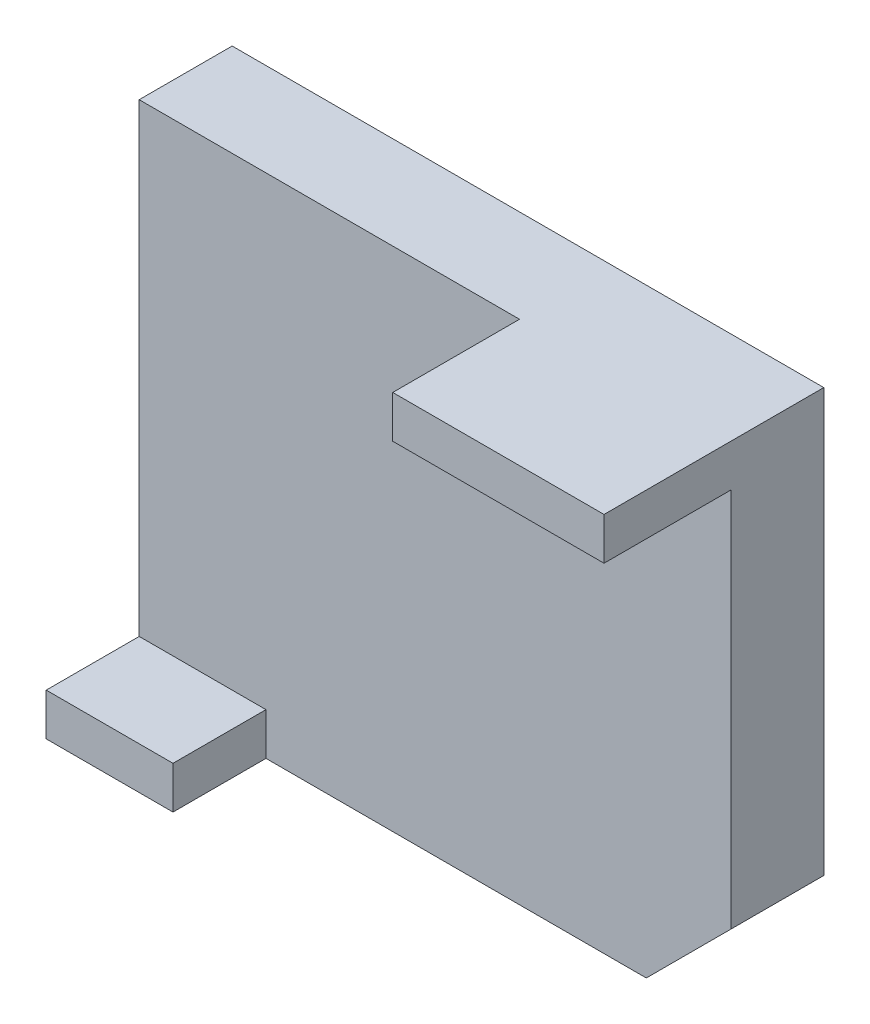
ISO-10303-21;
HEADER;
FILE_DESCRIPTION(('STEP AP214'),'2;1');
FILE_NAME('part.step','',(''),(''),'','','');
FILE_SCHEMA(('AUTOMOTIVE_DESIGN { 1 0 10303 214 1 1 1 1 }'));
ENDSEC;
DATA;
#1=APPLICATION_CONTEXT('core data for automotive mechanical design processes');
#2=APPLICATION_PROTOCOL_DEFINITION('international standard','automotive_design',2000,#1);
#3=PRODUCT_CONTEXT('',#1,'mechanical');
#4=PRODUCT('Part','Part','',(#3));
#5=PRODUCT_RELATED_PRODUCT_CATEGORY('part','',(#4));
#6=PRODUCT_DEFINITION_FORMATION('','',#4);
#7=PRODUCT_DEFINITION_CONTEXT('part definition',#1,'design');
#8=PRODUCT_DEFINITION('design','',#6,#7);
#9=PRODUCT_DEFINITION_SHAPE('','',#8);
#10=(LENGTH_UNIT() NAMED_UNIT(*) SI_UNIT(.MILLI.,.METRE.));
#11=(NAMED_UNIT(*) PLANE_ANGLE_UNIT() SI_UNIT($,.RADIAN.));
#12=(NAMED_UNIT(*) SI_UNIT($,.STERADIAN.) SOLID_ANGLE_UNIT());
#13=UNCERTAINTY_MEASURE_WITH_UNIT(LENGTH_MEASURE(1.E-05),#10,'distance_accuracy_value','');
#14=(GEOMETRIC_REPRESENTATION_CONTEXT(3) GLOBAL_UNCERTAINTY_ASSIGNED_CONTEXT((#13)) GLOBAL_UNIT_ASSIGNED_CONTEXT((#10,
#11,#12)) REPRESENTATION_CONTEXT('',''));
#15=CARTESIAN_POINT('',(0.,0.,0.));
#16=DIRECTION('',(0.,0.,1.));
#17=DIRECTION('',(1.,0.,0.));
#18=AXIS2_PLACEMENT_3D('',#15,#16,#17);
#19=CARTESIAN_POINT('',(0.,0.,22.));
#20=DIRECTION('',(0.,1.,0.));
#21=DIRECTION('',(0.,0.,1.));
#22=AXIS2_PLACEMENT_3D('',#19,#20,#21);
#23=PLANE('',#22);
#24=DIRECTION('',(1.,0.,0.));
#25=VECTOR('',#24,1.);
#26=CARTESIAN_POINT('',(0.,0.,0.));
#27=LINE('',#26,#25);
#28=CARTESIAN_POINT('',(0.,0.,0.));
#29=VERTEX_POINT('',#28);
#30=CARTESIAN_POINT('',(140.,0.,0.));
#31=VERTEX_POINT('',#30);
#32=EDGE_CURVE('E176',#29,#31,#27,.T.);
#33=ORIENTED_EDGE('',*,*,#32,.F.);
#34=DIRECTION('',(0.,0.,-1.));
#35=VECTOR('',#34,1.);
#36=CARTESIAN_POINT('',(0.,0.,22.));
#37=LINE('',#36,#35);
#38=CARTESIAN_POINT('',(0.,0.,22.));
#39=VERTEX_POINT('',#38);
#40=EDGE_CURVE('E11',#39,#29,#37,.T.);
#41=ORIENTED_EDGE('',*,*,#40,.F.);
#42=DIRECTION('',(1.,0.,0.));
#43=VECTOR('',#42,1.);
#44=CARTESIAN_POINT('',(0.,0.,22.));
#45=LINE('',#44,#43);
#46=CARTESIAN_POINT('',(90.,0.,22.));
#47=VERTEX_POINT('',#46);
#48=EDGE_CURVE('E138',#39,#47,#45,.T.);
#49=ORIENTED_EDGE('',*,*,#48,.T.);
#50=DIRECTION('',(0.,0.,-1.));
#51=VECTOR('',#50,1.);
#52=CARTESIAN_POINT('',(90.,0.,52.));
#53=LINE('',#52,#51);
#54=CARTESIAN_POINT('',(90.,0.,52.));
#55=VERTEX_POINT('',#54);
#56=EDGE_CURVE('E136',#55,#47,#53,.T.);
#57=ORIENTED_EDGE('',*,*,#56,.F.);
#58=DIRECTION('',(1.,0.,0.));
#59=VECTOR('',#58,1.);
#60=CARTESIAN_POINT('',(0.,0.,52.));
#61=LINE('',#60,#59);
#62=CARTESIAN_POINT('',(140.,0.,52.));
#63=VERTEX_POINT('',#62);
#64=EDGE_CURVE('E126',#55,#63,#61,.T.);
#65=ORIENTED_EDGE('',*,*,#64,.T.);
#66=DIRECTION('',(0.,0.,-1.));
#67=VECTOR('',#66,1.);
#68=CARTESIAN_POINT('',(140.,0.,52.));
#69=LINE('',#68,#67);
#70=EDGE_CURVE('E134',#63,#31,#69,.T.);
#71=ORIENTED_EDGE('',*,*,#70,.T.);
#72=EDGE_LOOP('',(#33,#41,#49,#57,#65,#71));
#73=FACE_BOUND('',#72,.T.);
#74=ADVANCED_FACE('F39',(#73),#23,.T.);
#75=CARTESIAN_POINT('',(0.,0.,22.));
#76=DIRECTION('',(1.,0.,0.));
#77=DIRECTION('',(0.,1.,0.));
#78=AXIS2_PLACEMENT_3D('',#75,#76,#77);
#79=PLANE('',#78);
#80=DIRECTION('',(0.,-1.,0.));
#81=VECTOR('',#80,1.);
#82=CARTESIAN_POINT('',(0.,0.,0.));
#83=LINE('',#82,#81);
#84=CARTESIAN_POINT('',(0.,-120.,0.));
#85=VERTEX_POINT('',#84);
#86=EDGE_CURVE('E198',#29,#85,#83,.T.);
#87=ORIENTED_EDGE('',*,*,#86,.T.);
#88=DIRECTION('',(0.,0.,-1.));
#89=VECTOR('',#88,1.);
#90=CARTESIAN_POINT('',(0.,-120.,44.));
#91=LINE('',#90,#89);
#92=CARTESIAN_POINT('',(0.,-120.,44.));
#93=VERTEX_POINT('',#92);
#94=EDGE_CURVE('E167',#93,#85,#91,.T.);
#95=ORIENTED_EDGE('',*,*,#94,.F.);
#96=DIRECTION('',(0.,-1.,0.));
#97=VECTOR('',#96,1.);
#98=CARTESIAN_POINT('',(0.,0.,44.));
#99=LINE('',#98,#97);
#100=CARTESIAN_POINT('',(0.,-110.,44.));
#101=VERTEX_POINT('',#100);
#102=EDGE_CURVE('E161',#101,#93,#99,.T.);
#103=ORIENTED_EDGE('',*,*,#102,.F.);
#104=DIRECTION('',(0.,0.,-1.));
#105=VECTOR('',#104,1.);
#106=CARTESIAN_POINT('',(0.,-110.,44.));
#107=LINE('',#106,#105);
#108=CARTESIAN_POINT('',(0.,-110.,22.));
#109=VERTEX_POINT('',#108);
#110=EDGE_CURVE('E170',#101,#109,#107,.T.);
#111=ORIENTED_EDGE('',*,*,#110,.T.);
#112=DIRECTION('',(0.,-1.,0.));
#113=VECTOR('',#112,1.);
#114=CARTESIAN_POINT('',(0.,0.,22.));
#115=LINE('',#114,#113);
#116=EDGE_CURVE('E183',#39,#109,#115,.T.);
#117=ORIENTED_EDGE('',*,*,#116,.F.);
#118=ORIENTED_EDGE('',*,*,#40,.T.);
#119=EDGE_LOOP('',(#87,#95,#103,#111,#117,#118));
#120=FACE_BOUND('',#119,.T.);
#121=ADVANCED_FACE('F229',(#120),#79,.F.);
#122=CARTESIAN_POINT('',(0.,-120.,22.));
#123=DIRECTION('',(0.,-1.,0.));
#124=DIRECTION('',(0.,0.,-1.));
#125=AXIS2_PLACEMENT_3D('',#122,#123,#124);
#126=PLANE('',#125);
#127=DIRECTION('',(-1.,0.,0.));
#128=VECTOR('',#127,1.);
#129=CARTESIAN_POINT('',(0.,-120.,0.));
#130=LINE('',#129,#128);
#131=CARTESIAN_POINT('',(120.,-120.,0.));
#132=VERTEX_POINT('',#131);
#133=EDGE_CURVE('E201',#132,#85,#130,.T.);
#134=ORIENTED_EDGE('',*,*,#133,.F.);
#135=DIRECTION('',(0.,0.,-1.));
#136=VECTOR('',#135,1.);
#137=CARTESIAN_POINT('',(120.,-120.,22.));
#138=LINE('',#137,#136);
#139=CARTESIAN_POINT('',(120.,-120.,22.));
#140=VERTEX_POINT('',#139);
#141=EDGE_CURVE('E47',#140,#132,#138,.T.);
#142=ORIENTED_EDGE('',*,*,#141,.F.);
#143=DIRECTION('',(-1.,0.,0.));
#144=VECTOR('',#143,1.);
#145=CARTESIAN_POINT('',(0.,-120.,22.));
#146=LINE('',#145,#144);
#147=CARTESIAN_POINT('',(30.,-120.,22.));
#148=VERTEX_POINT('',#147);
#149=EDGE_CURVE('E190',#140,#148,#146,.T.);
#150=ORIENTED_EDGE('',*,*,#149,.T.);
#151=DIRECTION('',(0.,0.,-1.));
#152=VECTOR('',#151,1.);
#153=CARTESIAN_POINT('',(30.,-120.,44.));
#154=LINE('',#153,#152);
#155=CARTESIAN_POINT('',(30.,-120.,44.));
#156=VERTEX_POINT('',#155);
#157=EDGE_CURVE('E165',#156,#148,#154,.T.);
#158=ORIENTED_EDGE('',*,*,#157,.F.);
#159=DIRECTION('',(1.,0.,0.));
#160=VECTOR('',#159,1.);
#161=CARTESIAN_POINT('',(0.,-120.,44.));
#162=LINE('',#161,#160);
#163=EDGE_CURVE('E163',#93,#156,#162,.T.);
#164=ORIENTED_EDGE('',*,*,#163,.F.);
#165=ORIENTED_EDGE('',*,*,#94,.T.);
#166=EDGE_LOOP('',(#134,#142,#150,#158,#164,#165));
#167=FACE_BOUND('',#166,.T.);
#168=ADVANCED_FACE('F222',(#167),#126,.T.);
#169=CARTESIAN_POINT('',(120.,-120.,22.));
#170=DIRECTION('',(0.707106781186548,-0.707106781186547,0.));
#171=DIRECTION('',(0.707106781186547,0.707106781186548,0.));
#172=AXIS2_PLACEMENT_3D('',#169,#170,#171);
#173=PLANE('',#172);
#174=DIRECTION('',(-0.707106781186547,-0.707106781186548,0.));
#175=VECTOR('',#174,1.);
#176=CARTESIAN_POINT('',(120.,-120.,0.));
#177=LINE('',#176,#175);
#178=CARTESIAN_POINT('',(140.,-100.,0.));
#179=VERTEX_POINT('',#178);
#180=EDGE_CURVE('E203',#179,#132,#177,.T.);
#181=ORIENTED_EDGE('',*,*,#180,.F.);
#182=DIRECTION('',(0.,0.,-1.));
#183=VECTOR('',#182,1.);
#184=CARTESIAN_POINT('',(140.,-100.,22.));
#185=LINE('',#184,#183);
#186=CARTESIAN_POINT('',(140.,-100.,22.));
#187=VERTEX_POINT('',#186);
#188=EDGE_CURVE('E55',#187,#179,#185,.T.);
#189=ORIENTED_EDGE('',*,*,#188,.F.);
#190=DIRECTION('',(-0.707106781186547,-0.707106781186548,0.));
#191=VECTOR('',#190,1.);
#192=CARTESIAN_POINT('',(120.,-120.,22.));
#193=LINE('',#192,#191);
#194=EDGE_CURVE('E193',#187,#140,#193,.T.);
#195=ORIENTED_EDGE('',*,*,#194,.T.);
#196=ORIENTED_EDGE('',*,*,#141,.T.);
#197=EDGE_LOOP('',(#181,#189,#195,#196));
#198=FACE_BOUND('',#197,.T.);
#199=ADVANCED_FACE('F220',(#198),#173,.T.);
#200=CARTESIAN_POINT('',(140.,0.,22.));
#201=DIRECTION('',(1.,0.,0.));
#202=DIRECTION('',(0.,0.,-1.));
#203=AXIS2_PLACEMENT_3D('',#200,#201,#202);
#204=PLANE('',#203);
#205=DIRECTION('',(0.,-1.,0.));
#206=VECTOR('',#205,1.);
#207=CARTESIAN_POINT('',(140.,0.,0.));
#208=LINE('',#207,#206);
#209=EDGE_CURVE('E180',#31,#179,#208,.T.);
#210=ORIENTED_EDGE('',*,*,#209,.F.);
#211=ORIENTED_EDGE('',*,*,#70,.F.);
#212=DIRECTION('',(0.,-1.,0.));
#213=VECTOR('',#212,1.);
#214=CARTESIAN_POINT('',(140.,0.,52.));
#215=LINE('',#214,#213);
#216=CARTESIAN_POINT('',(140.,-10.,52.));
#217=VERTEX_POINT('',#216);
#218=EDGE_CURVE('E132',#63,#217,#215,.T.);
#219=ORIENTED_EDGE('',*,*,#218,.T.);
#220=DIRECTION('',(0.,0.,-1.));
#221=VECTOR('',#220,1.);
#222=CARTESIAN_POINT('',(140.,-10.,52.));
#223=LINE('',#222,#221);
#224=CARTESIAN_POINT('',(140.,-10.,22.));
#225=VERTEX_POINT('',#224);
#226=EDGE_CURVE('E153',#217,#225,#223,.T.);
#227=ORIENTED_EDGE('',*,*,#226,.T.);
#228=DIRECTION('',(0.,-1.,0.));
#229=VECTOR('',#228,1.);
#230=CARTESIAN_POINT('',(140.,0.,22.));
#231=LINE('',#230,#229);
#232=EDGE_CURVE('E195',#225,#187,#231,.T.);
#233=ORIENTED_EDGE('',*,*,#232,.T.);
#234=ORIENTED_EDGE('',*,*,#188,.T.);
#235=EDGE_LOOP('',(#210,#211,#219,#227,#233,#234));
#236=FACE_BOUND('',#235,.T.);
#237=ADVANCED_FACE('F211',(#236),#204,.T.);
#238=CARTESIAN_POINT('',(0.,0.,22.));
#239=DIRECTION('',(0.,0.,1.));
#240=DIRECTION('',(1.,0.,0.));
#241=AXIS2_PLACEMENT_3D('',#238,#239,#240);
#242=PLANE('',#241);
#243=DIRECTION('',(1.,0.,0.));
#244=VECTOR('',#243,1.);
#245=CARTESIAN_POINT('',(0.,-10.,22.));
#246=LINE('',#245,#244);
#247=CARTESIAN_POINT('',(90.,-10.,22.));
#248=VERTEX_POINT('',#247);
#249=EDGE_CURVE('E177',#248,#225,#246,.T.);
#250=ORIENTED_EDGE('',*,*,#249,.F.);
#251=DIRECTION('',(0.,1.,0.));
#252=VECTOR('',#251,1.);
#253=CARTESIAN_POINT('',(90.,0.,22.));
#254=LINE('',#253,#252);
#255=EDGE_CURVE('E179',#248,#47,#254,.T.);
#256=ORIENTED_EDGE('',*,*,#255,.T.);
#257=ORIENTED_EDGE('',*,*,#48,.F.);
#258=ORIENTED_EDGE('',*,*,#116,.T.);
#259=DIRECTION('',(-1.,0.,0.));
#260=VECTOR('',#259,1.);
#261=CARTESIAN_POINT('',(0.,-110.,22.));
#262=LINE('',#261,#260);
#263=CARTESIAN_POINT('',(30.,-110.,22.));
#264=VERTEX_POINT('',#263);
#265=EDGE_CURVE('E186',#264,#109,#262,.T.);
#266=ORIENTED_EDGE('',*,*,#265,.F.);
#267=DIRECTION('',(0.,1.,0.));
#268=VECTOR('',#267,1.);
#269=CARTESIAN_POINT('',(30.,0.,22.));
#270=LINE('',#269,#268);
#271=EDGE_CURVE('E188',#148,#264,#270,.T.);
#272=ORIENTED_EDGE('',*,*,#271,.F.);
#273=ORIENTED_EDGE('',*,*,#149,.F.);
#274=ORIENTED_EDGE('',*,*,#194,.F.);
#275=ORIENTED_EDGE('',*,*,#232,.F.);
#276=EDGE_LOOP('',(#250,#256,#257,#258,#266,#272,#273,#274,#275));
#277=FACE_BOUND('',#276,.T.);
#278=ADVANCED_FACE('F217',(#277),#242,.T.);
#279=CARTESIAN_POINT('',(0.,0.,0.));
#280=DIRECTION('',(0.,0.,1.));
#281=DIRECTION('',(1.,0.,0.));
#282=AXIS2_PLACEMENT_3D('',#279,#280,#281);
#283=PLANE('',#282);
#284=ORIENTED_EDGE('',*,*,#32,.T.);
#285=ORIENTED_EDGE('',*,*,#209,.T.);
#286=ORIENTED_EDGE('',*,*,#180,.T.);
#287=ORIENTED_EDGE('',*,*,#133,.T.);
#288=ORIENTED_EDGE('',*,*,#86,.F.);
#289=EDGE_LOOP('',(#284,#285,#286,#287,#288));
#290=FACE_BOUND('',#289,.T.);
#291=ADVANCED_FACE('F209',(#290),#283,.F.);
#292=CARTESIAN_POINT('',(30.,0.,44.));
#293=DIRECTION('',(-1.,0.,0.));
#294=DIRECTION('',(0.,0.,1.));
#295=AXIS2_PLACEMENT_3D('',#292,#293,#294);
#296=PLANE('',#295);
#297=ORIENTED_EDGE('',*,*,#271,.T.);
#298=DIRECTION('',(0.,0.,-1.));
#299=VECTOR('',#298,1.);
#300=CARTESIAN_POINT('',(30.,-110.,44.));
#301=LINE('',#300,#299);
#302=CARTESIAN_POINT('',(30.,-110.,44.));
#303=VERTEX_POINT('',#302);
#304=EDGE_CURVE('E173',#303,#264,#301,.T.);
#305=ORIENTED_EDGE('',*,*,#304,.F.);
#306=DIRECTION('',(0.,1.,0.));
#307=VECTOR('',#306,1.);
#308=CARTESIAN_POINT('',(30.,0.,44.));
#309=LINE('',#308,#307);
#310=EDGE_CURVE('E156',#156,#303,#309,.T.);
#311=ORIENTED_EDGE('',*,*,#310,.F.);
#312=ORIENTED_EDGE('',*,*,#157,.T.);
#313=EDGE_LOOP('',(#297,#305,#311,#312));
#314=FACE_BOUND('',#313,.T.);
#315=ADVANCED_FACE('F264',(#314),#296,.F.);
#316=CARTESIAN_POINT('',(0.,-110.,44.));
#317=DIRECTION('',(0.,-1.,0.));
#318=DIRECTION('',(1.,0.,0.));
#319=AXIS2_PLACEMENT_3D('',#316,#317,#318);
#320=PLANE('',#319);
#321=ORIENTED_EDGE('',*,*,#265,.T.);
#322=ORIENTED_EDGE('',*,*,#110,.F.);
#323=DIRECTION('',(-1.,0.,0.));
#324=VECTOR('',#323,1.);
#325=CARTESIAN_POINT('',(0.,-110.,44.));
#326=LINE('',#325,#324);
#327=EDGE_CURVE('E159',#303,#101,#326,.T.);
#328=ORIENTED_EDGE('',*,*,#327,.F.);
#329=ORIENTED_EDGE('',*,*,#304,.T.);
#330=EDGE_LOOP('',(#321,#322,#328,#329));
#331=FACE_BOUND('',#330,.T.);
#332=ADVANCED_FACE('F258',(#331),#320,.F.);
#333=CARTESIAN_POINT('',(0.,0.,44.));
#334=DIRECTION('',(0.,0.,1.));
#335=DIRECTION('',(1.,0.,0.));
#336=AXIS2_PLACEMENT_3D('',#333,#334,#335);
#337=PLANE('',#336);
#338=ORIENTED_EDGE('',*,*,#310,.T.);
#339=ORIENTED_EDGE('',*,*,#327,.T.);
#340=ORIENTED_EDGE('',*,*,#102,.T.);
#341=ORIENTED_EDGE('',*,*,#163,.T.);
#342=EDGE_LOOP('',(#338,#339,#340,#341));
#343=FACE_BOUND('',#342,.T.);
#344=ADVANCED_FACE('F245',(#343),#337,.T.);
#345=CARTESIAN_POINT('',(0.,-10.,52.));
#346=DIRECTION('',(0.,1.,0.));
#347=DIRECTION('',(-1.,0.,0.));
#348=AXIS2_PLACEMENT_3D('',#345,#346,#347);
#349=PLANE('',#348);
#350=ORIENTED_EDGE('',*,*,#249,.T.);
#351=ORIENTED_EDGE('',*,*,#226,.F.);
#352=DIRECTION('',(1.,0.,0.));
#353=VECTOR('',#352,1.);
#354=CARTESIAN_POINT('',(0.,-10.,52.));
#355=LINE('',#354,#353);
#356=CARTESIAN_POINT('',(90.,-10.,52.));
#357=VERTEX_POINT('',#356);
#358=EDGE_CURVE('E141',#357,#217,#355,.T.);
#359=ORIENTED_EDGE('',*,*,#358,.F.);
#360=DIRECTION('',(0.,0.,-1.));
#361=VECTOR('',#360,1.);
#362=CARTESIAN_POINT('',(90.,-10.,52.));
#363=LINE('',#362,#361);
#364=EDGE_CURVE('E142',#357,#248,#363,.T.);
#365=ORIENTED_EDGE('',*,*,#364,.T.);
#366=EDGE_LOOP('',(#350,#351,#359,#365));
#367=FACE_BOUND('',#366,.T.);
#368=ADVANCED_FACE('F250',(#367),#349,.F.);
#369=CARTESIAN_POINT('',(0.,0.,52.));
#370=DIRECTION('',(0.,0.,1.));
#371=DIRECTION('',(1.,0.,0.));
#372=AXIS2_PLACEMENT_3D('',#369,#370,#371);
#373=PLANE('',#372);
#374=ORIENTED_EDGE('',*,*,#64,.F.);
#375=DIRECTION('',(0.,1.,0.));
#376=VECTOR('',#375,1.);
#377=CARTESIAN_POINT('',(90.,0.,52.));
#378=LINE('',#377,#376);
#379=EDGE_CURVE('E130',#357,#55,#378,.T.);
#380=ORIENTED_EDGE('',*,*,#379,.F.);
#381=ORIENTED_EDGE('',*,*,#358,.T.);
#382=ORIENTED_EDGE('',*,*,#218,.F.);
#383=EDGE_LOOP('',(#374,#380,#381,#382));
#384=FACE_BOUND('',#383,.T.);
#385=ADVANCED_FACE('F128',(#384),#373,.T.);
#386=CARTESIAN_POINT('',(90.,0.,52.));
#387=DIRECTION('',(-1.,0.,0.));
#388=DIRECTION('',(0.,0.,1.));
#389=AXIS2_PLACEMENT_3D('',#386,#387,#388);
#390=PLANE('',#389);
#391=ORIENTED_EDGE('',*,*,#56,.T.);
#392=ORIENTED_EDGE('',*,*,#255,.F.);
#393=ORIENTED_EDGE('',*,*,#364,.F.);
#394=ORIENTED_EDGE('',*,*,#379,.T.);
#395=EDGE_LOOP('',(#391,#392,#393,#394));
#396=FACE_BOUND('',#395,.T.);
#397=ADVANCED_FACE('F145',(#396),#390,.T.);
#398=CLOSED_SHELL('',(#74,#121,#168,#199,#237,#278,#291,#315,#332,#344,#368,#385,#397));
#399=MANIFOLD_SOLID_BREP('B2',#398);
#400=ADVANCED_BREP_SHAPE_REPRESENTATION('',(#18,#399),#14);
#401=SHAPE_DEFINITION_REPRESENTATION(#9,#400);
ENDSEC;
END-ISO-10303-21;
